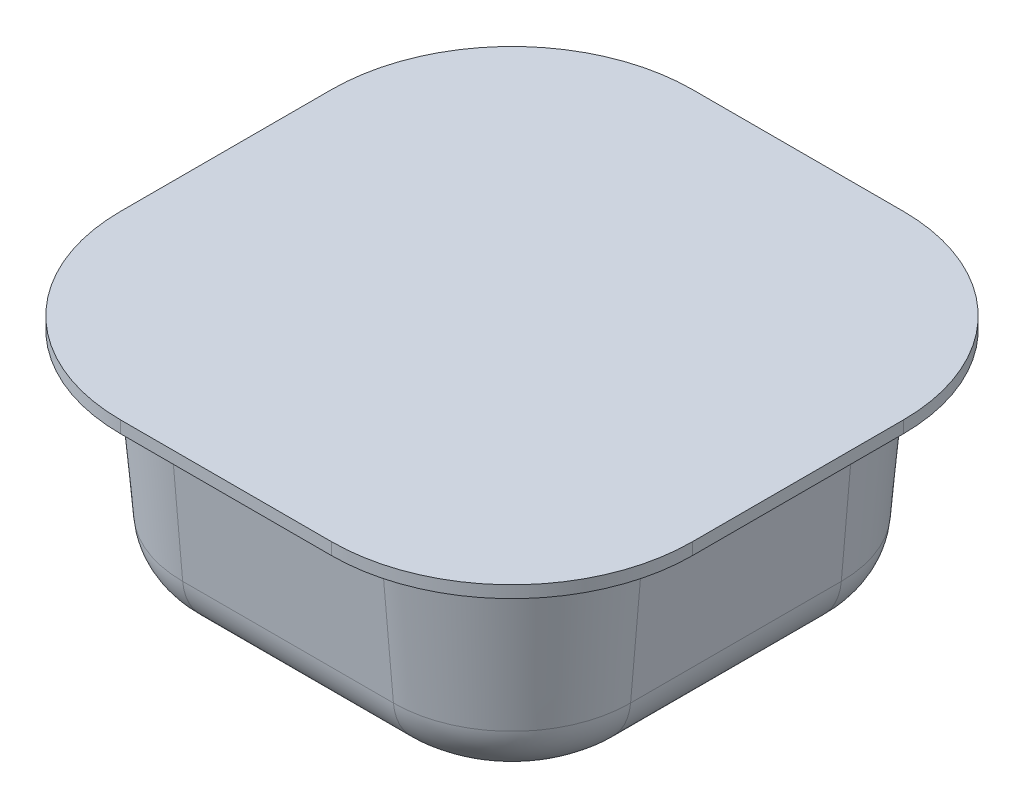
ISO-10303-21;
HEADER;
FILE_DESCRIPTION(('STEP AP214'),'2;1');
FILE_NAME('part.step','',(''),(''),'','','');
FILE_SCHEMA(('AUTOMOTIVE_DESIGN { 1 0 10303 214 1 1 1 1 }'));
ENDSEC;
DATA;
#1=APPLICATION_CONTEXT('core data for automotive mechanical design processes');
#2=APPLICATION_PROTOCOL_DEFINITION('international standard','automotive_design',2000,#1);
#3=PRODUCT_CONTEXT('',#1,'mechanical');
#4=PRODUCT('Part','Part','',(#3));
#5=PRODUCT_RELATED_PRODUCT_CATEGORY('part','',(#4));
#6=PRODUCT_DEFINITION_FORMATION('','',#4);
#7=PRODUCT_DEFINITION_CONTEXT('part definition',#1,'design');
#8=PRODUCT_DEFINITION('design','',#6,#7);
#9=PRODUCT_DEFINITION_SHAPE('','',#8);
#10=(LENGTH_UNIT() NAMED_UNIT(*) SI_UNIT(.MILLI.,.METRE.));
#11=(NAMED_UNIT(*) PLANE_ANGLE_UNIT() SI_UNIT($,.RADIAN.));
#12=(NAMED_UNIT(*) SI_UNIT($,.STERADIAN.) SOLID_ANGLE_UNIT());
#13=UNCERTAINTY_MEASURE_WITH_UNIT(LENGTH_MEASURE(1.E-05),#10,'distance_accuracy_value','');
#14=(GEOMETRIC_REPRESENTATION_CONTEXT(3) GLOBAL_UNCERTAINTY_ASSIGNED_CONTEXT((#13)) GLOBAL_UNIT_ASSIGNED_CONTEXT((#10,
#11,#12)) REPRESENTATION_CONTEXT('',''));
#15=CARTESIAN_POINT('',(0.,0.,0.));
#16=DIRECTION('',(0.,0.,1.));
#17=DIRECTION('',(1.,0.,0.));
#18=AXIS2_PLACEMENT_3D('',#15,#16,#17);
#19=CARTESIAN_POINT('',(-24.13,18.034,-24.13));
#20=DIRECTION('',(-1.,0.,0.));
#21=DIRECTION('',(0.,0.,1.));
#22=AXIS2_PLACEMENT_3D('',#19,#20,#21);
#23=PLANE('',#22);
#24=DIRECTION('',(0.,0.,1.));
#25=VECTOR('',#24,1.);
#26=CARTESIAN_POINT('',(-24.13,18.034,-24.13));
#27=LINE('',#26,#25);
#28=CARTESIAN_POINT('',(-24.13,18.034,-8.89));
#29=VERTEX_POINT('',#28);
#30=CARTESIAN_POINT('',(-24.13,18.034,8.88999999999999));
#31=VERTEX_POINT('',#30);
#32=EDGE_CURVE('E258',#29,#31,#27,.T.);
#33=ORIENTED_EDGE('',*,*,#32,.T.);
#34=DIRECTION('',(0.,1.,0.));
#35=VECTOR('',#34,1.);
#36=CARTESIAN_POINT('',(-24.13,18.034,8.89000000000001));
#37=LINE('',#36,#35);
#38=CARTESIAN_POINT('',(-24.13,19.05,8.88999999999999));
#39=VERTEX_POINT('',#38);
#40=EDGE_CURVE('E292',#31,#39,#37,.T.);
#41=ORIENTED_EDGE('',*,*,#40,.T.);
#42=DIRECTION('',(0.,0.,1.));
#43=VECTOR('',#42,1.);
#44=CARTESIAN_POINT('',(-24.13,19.05,-24.13));
#45=LINE('',#44,#43);
#46=CARTESIAN_POINT('',(-24.13,19.05,-8.89));
#47=VERTEX_POINT('',#46);
#48=EDGE_CURVE('E241',#47,#39,#45,.T.);
#49=ORIENTED_EDGE('',*,*,#48,.F.);
#50=DIRECTION('',(0.,1.,0.));
#51=VECTOR('',#50,1.);
#52=CARTESIAN_POINT('',(-24.13,18.034,-8.88999999999999));
#53=LINE('',#52,#51);
#54=EDGE_CURVE('E275',#47,#29,#53,.F.);
#55=ORIENTED_EDGE('',*,*,#54,.T.);
#56=EDGE_LOOP('',(#33,#41,#49,#55));
#57=FACE_BOUND('',#56,.T.);
#58=ADVANCED_FACE('F47',(#57),#23,.T.);
#59=CARTESIAN_POINT('',(24.13,18.034,-24.13));
#60=DIRECTION('',(0.,0.,-1.));
#61=DIRECTION('',(-1.,0.,0.));
#62=AXIS2_PLACEMENT_3D('',#59,#60,#61);
#63=PLANE('',#62);
#64=DIRECTION('',(-1.,0.,0.));
#65=VECTOR('',#64,1.);
#66=CARTESIAN_POINT('',(24.13,19.05,-24.13));
#67=LINE('',#66,#65);
#68=CARTESIAN_POINT('',(8.89,19.05,-24.13));
#69=VERTEX_POINT('',#68);
#70=CARTESIAN_POINT('',(-8.88999999999999,19.05,-24.13));
#71=VERTEX_POINT('',#70);
#72=EDGE_CURVE('E263',#69,#71,#67,.T.);
#73=ORIENTED_EDGE('',*,*,#72,.F.);
#74=DIRECTION('',(0.,1.,0.));
#75=VECTOR('',#74,1.);
#76=CARTESIAN_POINT('',(8.88999999999999,18.034,-24.13));
#77=LINE('',#76,#75);
#78=CARTESIAN_POINT('',(8.89,18.034,-24.13));
#79=VERTEX_POINT('',#78);
#80=EDGE_CURVE('E338',#69,#79,#77,.F.);
#81=ORIENTED_EDGE('',*,*,#80,.T.);
#82=DIRECTION('',(-1.,0.,0.));
#83=VECTOR('',#82,1.);
#84=CARTESIAN_POINT('',(24.13,18.034,-24.13));
#85=LINE('',#84,#83);
#86=CARTESIAN_POINT('',(-8.88999999999999,18.034,-24.13));
#87=VERTEX_POINT('',#86);
#88=EDGE_CURVE('E271',#79,#87,#85,.T.);
#89=ORIENTED_EDGE('',*,*,#88,.T.);
#90=DIRECTION('',(0.,1.,0.));
#91=VECTOR('',#90,1.);
#92=CARTESIAN_POINT('',(-8.89000000000001,18.034,-24.13));
#93=LINE('',#92,#91);
#94=EDGE_CURVE('E334',#87,#71,#93,.T.);
#95=ORIENTED_EDGE('',*,*,#94,.T.);
#96=EDGE_LOOP('',(#73,#81,#89,#95));
#97=FACE_BOUND('',#96,.T.);
#98=ADVANCED_FACE('F462',(#97),#63,.T.);
#99=CARTESIAN_POINT('',(24.13,18.034,-24.13));
#100=DIRECTION('',(1.,0.,0.));
#101=DIRECTION('',(0.,0.,-1.));
#102=AXIS2_PLACEMENT_3D('',#99,#100,#101);
#103=PLANE('',#102);
#104=DIRECTION('',(0.,0.,-1.));
#105=VECTOR('',#104,1.);
#106=CARTESIAN_POINT('',(24.13,18.034,-24.13));
#107=LINE('',#106,#105);
#108=CARTESIAN_POINT('',(24.13,18.034,8.88999999999998));
#109=VERTEX_POINT('',#108);
#110=CARTESIAN_POINT('',(24.13,18.034,-8.89));
#111=VERTEX_POINT('',#110);
#112=EDGE_CURVE('E267',#109,#111,#107,.T.);
#113=ORIENTED_EDGE('',*,*,#112,.T.);
#114=DIRECTION('',(0.,1.,0.));
#115=VECTOR('',#114,1.);
#116=CARTESIAN_POINT('',(24.13,18.034,-8.89));
#117=LINE('',#116,#115);
#118=CARTESIAN_POINT('',(24.13,19.05,-8.89));
#119=VERTEX_POINT('',#118);
#120=EDGE_CURVE('E330',#111,#119,#117,.T.);
#121=ORIENTED_EDGE('',*,*,#120,.T.);
#122=DIRECTION('',(0.,0.,-1.));
#123=VECTOR('',#122,1.);
#124=CARTESIAN_POINT('',(24.13,19.05,-24.13));
#125=LINE('',#124,#123);
#126=CARTESIAN_POINT('',(24.13,19.05,8.88999999999998));
#127=VERTEX_POINT('',#126);
#128=EDGE_CURVE('E283',#127,#119,#125,.T.);
#129=ORIENTED_EDGE('',*,*,#128,.F.);
#130=DIRECTION('',(0.,1.,0.));
#131=VECTOR('',#130,1.);
#132=CARTESIAN_POINT('',(24.13,18.034,8.88999999999999));
#133=LINE('',#132,#131);
#134=EDGE_CURVE('E327',#127,#109,#133,.F.);
#135=ORIENTED_EDGE('',*,*,#134,.T.);
#136=EDGE_LOOP('',(#113,#121,#129,#135));
#137=FACE_BOUND('',#136,.T.);
#138=ADVANCED_FACE('F468',(#137),#103,.T.);
#139=CARTESIAN_POINT('',(24.13,18.034,24.13));
#140=DIRECTION('',(0.,0.,1.));
#141=DIRECTION('',(1.,0.,0.));
#142=AXIS2_PLACEMENT_3D('',#139,#140,#141);
#143=PLANE('',#142);
#144=DIRECTION('',(1.,0.,0.));
#145=VECTOR('',#144,1.);
#146=CARTESIAN_POINT('',(24.13,19.05,24.13));
#147=LINE('',#146,#145);
#148=CARTESIAN_POINT('',(-8.88999999999998,19.05,24.13));
#149=VERTEX_POINT('',#148);
#150=CARTESIAN_POINT('',(8.89,19.05,24.13));
#151=VERTEX_POINT('',#150);
#152=EDGE_CURVE('E279',#149,#151,#147,.T.);
#153=ORIENTED_EDGE('',*,*,#152,.F.);
#154=DIRECTION('',(0.,1.,0.));
#155=VECTOR('',#154,1.);
#156=CARTESIAN_POINT('',(-8.88999999999999,18.034,24.13));
#157=LINE('',#156,#155);
#158=CARTESIAN_POINT('',(-8.88999999999998,18.034,24.13));
#159=VERTEX_POINT('',#158);
#160=EDGE_CURVE('E312',#149,#159,#157,.F.);
#161=ORIENTED_EDGE('',*,*,#160,.T.);
#162=DIRECTION('',(1.,0.,0.));
#163=VECTOR('',#162,1.);
#164=CARTESIAN_POINT('',(24.13,18.034,24.13));
#165=LINE('',#164,#163);
#166=CARTESIAN_POINT('',(8.89,18.034,24.13));
#167=VERTEX_POINT('',#166);
#168=EDGE_CURVE('E262',#159,#167,#165,.T.);
#169=ORIENTED_EDGE('',*,*,#168,.T.);
#170=DIRECTION('',(0.,1.,0.));
#171=VECTOR('',#170,1.);
#172=CARTESIAN_POINT('',(8.89,18.034,24.13));
#173=LINE('',#172,#171);
#174=EDGE_CURVE('E308',#167,#151,#173,.T.);
#175=ORIENTED_EDGE('',*,*,#174,.T.);
#176=EDGE_LOOP('',(#153,#161,#169,#175));
#177=FACE_BOUND('',#176,.T.);
#178=ADVANCED_FACE('F473',(#177),#143,.T.);
#179=CARTESIAN_POINT('',(0.,18.034,0.));
#180=DIRECTION('',(0.,-1.,0.));
#181=DIRECTION('',(0.,0.,-1.));
#182=AXIS2_PLACEMENT_3D('',#179,#180,#181);
#183=PLANE('',#182);
#184=CARTESIAN_POINT('',(8.89,18.034,8.89));
#185=DIRECTION('',(0.,-1.,0.));
#186=DIRECTION('',(0.,0.,-1.));
#187=AXIS2_PLACEMENT_3D('',#184,#185,#186);
#188=CIRCLE('',#187,11.176);
#189=CARTESIAN_POINT('',(20.066,18.034,8.88999999999998));
#190=VERTEX_POINT('',#189);
#191=CARTESIAN_POINT('',(8.89,18.034,20.066));
#192=VERTEX_POINT('',#191);
#193=EDGE_CURVE('E215',#190,#192,#188,.T.);
#194=ORIENTED_EDGE('',*,*,#193,.F.);
#195=DIRECTION('',(0.,0.,1.));
#196=VECTOR('',#195,1.);
#197=CARTESIAN_POINT('',(20.066,18.034,-8.89));
#198=LINE('',#197,#196);
#199=CARTESIAN_POINT('',(20.066,18.034,-8.89));
#200=VERTEX_POINT('',#199);
#201=EDGE_CURVE('E234',#200,#190,#198,.T.);
#202=ORIENTED_EDGE('',*,*,#201,.F.);
#203=CARTESIAN_POINT('',(8.89,18.034,-8.89));
#204=DIRECTION('',(0.,-1.,0.));
#205=DIRECTION('',(0.,0.,-1.));
#206=AXIS2_PLACEMENT_3D('',#203,#204,#205);
#207=CIRCLE('',#206,11.176);
#208=CARTESIAN_POINT('',(8.89,18.034,-20.066));
#209=VERTEX_POINT('',#208);
#210=EDGE_CURVE('E230',#209,#200,#207,.T.);
#211=ORIENTED_EDGE('',*,*,#210,.F.);
#212=DIRECTION('',(1.,0.,0.));
#213=VECTOR('',#212,1.);
#214=CARTESIAN_POINT('',(-8.88999999999999,18.034,-20.066));
#215=LINE('',#214,#213);
#216=CARTESIAN_POINT('',(-8.89,18.034,-20.066));
#217=VERTEX_POINT('',#216);
#218=EDGE_CURVE('E226',#217,#209,#215,.T.);
#219=ORIENTED_EDGE('',*,*,#218,.F.);
#220=CARTESIAN_POINT('',(-8.89,18.034,-8.89));
#221=DIRECTION('',(0.,-1.,0.));
#222=DIRECTION('',(0.,0.,-1.));
#223=AXIS2_PLACEMENT_3D('',#220,#221,#222);
#224=CIRCLE('',#223,11.176);
#225=CARTESIAN_POINT('',(-20.066,18.034,-8.89));
#226=VERTEX_POINT('',#225);
#227=EDGE_CURVE('E222',#226,#217,#224,.T.);
#228=ORIENTED_EDGE('',*,*,#227,.F.);
#229=DIRECTION('',(0.,0.,-1.));
#230=VECTOR('',#229,1.);
#231=CARTESIAN_POINT('',(-20.066,18.034,8.89));
#232=LINE('',#231,#230);
#233=CARTESIAN_POINT('',(-20.066,18.034,8.89));
#234=VERTEX_POINT('',#233);
#235=EDGE_CURVE('E209',#234,#226,#232,.T.);
#236=ORIENTED_EDGE('',*,*,#235,.F.);
#237=CARTESIAN_POINT('',(-8.89,18.034,8.89));
#238=DIRECTION('',(0.,-1.,0.));
#239=DIRECTION('',(0.,0.,-1.));
#240=AXIS2_PLACEMENT_3D('',#237,#238,#239);
#241=CIRCLE('',#240,11.176);
#242=CARTESIAN_POINT('',(-8.88999999999998,18.034,20.066));
#243=VERTEX_POINT('',#242);
#244=EDGE_CURVE('E189',#243,#234,#241,.T.);
#245=ORIENTED_EDGE('',*,*,#244,.F.);
#246=DIRECTION('',(-1.,0.,0.));
#247=VECTOR('',#246,1.);
#248=CARTESIAN_POINT('',(8.89,18.034,20.066));
#249=LINE('',#248,#247);
#250=EDGE_CURVE('E205',#192,#243,#249,.T.);
#251=ORIENTED_EDGE('',*,*,#250,.F.);
#252=EDGE_LOOP('',(#194,#202,#211,#219,#228,#236,#245,#251));
#253=FACE_BOUND('',#252,.T.);
#254=ORIENTED_EDGE('',*,*,#168,.F.);
#255=CARTESIAN_POINT('',(-8.89,18.034,8.89));
#256=DIRECTION('',(0.,-1.,0.));
#257=DIRECTION('',(0.,0.,-1.));
#258=AXIS2_PLACEMENT_3D('',#255,#256,#257);
#259=CIRCLE('',#258,15.24);
#260=EDGE_CURVE('E324',#159,#31,#259,.T.);
#261=ORIENTED_EDGE('',*,*,#260,.T.);
#262=ORIENTED_EDGE('',*,*,#32,.F.);
#263=CARTESIAN_POINT('',(-8.89,18.034,-8.89));
#264=DIRECTION('',(0.,-1.,0.));
#265=DIRECTION('',(0.,0.,-1.));
#266=AXIS2_PLACEMENT_3D('',#263,#264,#265);
#267=CIRCLE('',#266,15.24);
#268=EDGE_CURVE('E318',#29,#87,#267,.T.);
#269=ORIENTED_EDGE('',*,*,#268,.T.);
#270=ORIENTED_EDGE('',*,*,#88,.F.);
#271=CARTESIAN_POINT('',(8.89,18.034,-8.89));
#272=DIRECTION('',(0.,-1.,0.));
#273=DIRECTION('',(0.,0.,-1.));
#274=AXIS2_PLACEMENT_3D('',#271,#272,#273);
#275=CIRCLE('',#274,15.24);
#276=EDGE_CURVE('E321',#79,#111,#275,.T.);
#277=ORIENTED_EDGE('',*,*,#276,.T.);
#278=ORIENTED_EDGE('',*,*,#112,.F.);
#279=CARTESIAN_POINT('',(8.89,18.034,8.89));
#280=DIRECTION('',(0.,-1.,0.));
#281=DIRECTION('',(0.,0.,-1.));
#282=AXIS2_PLACEMENT_3D('',#279,#280,#281);
#283=CIRCLE('',#282,15.24);
#284=EDGE_CURVE('E315',#109,#167,#283,.T.);
#285=ORIENTED_EDGE('',*,*,#284,.T.);
#286=EDGE_LOOP('',(#254,#261,#262,#269,#270,#277,#278,#285));
#287=FACE_BOUND('',#286,.T.);
#288=ADVANCED_FACE('F203',(#253,#287),#183,.T.);
#289=CARTESIAN_POINT('',(0.,19.05,0.));
#290=DIRECTION('',(0.,-1.,0.));
#291=DIRECTION('',(0.,0.,-1.));
#292=AXIS2_PLACEMENT_3D('',#289,#290,#291);
#293=PLANE('',#292);
#294=ORIENTED_EDGE('',*,*,#48,.T.);
#295=CARTESIAN_POINT('',(-8.89,19.05,8.89));
#296=DIRECTION('',(0.,-1.,0.));
#297=DIRECTION('',(0.,0.,-1.));
#298=AXIS2_PLACEMENT_3D('',#295,#296,#297);
#299=CIRCLE('',#298,15.24);
#300=EDGE_CURVE('E305',#39,#149,#299,.F.);
#301=ORIENTED_EDGE('',*,*,#300,.T.);
#302=ORIENTED_EDGE('',*,*,#152,.T.);
#303=CARTESIAN_POINT('',(8.89,19.05,8.89));
#304=DIRECTION('',(0.,-1.,0.));
#305=DIRECTION('',(0.,0.,-1.));
#306=AXIS2_PLACEMENT_3D('',#303,#304,#305);
#307=CIRCLE('',#306,15.24);
#308=EDGE_CURVE('E296',#151,#127,#307,.F.);
#309=ORIENTED_EDGE('',*,*,#308,.T.);
#310=ORIENTED_EDGE('',*,*,#128,.T.);
#311=CARTESIAN_POINT('',(8.89,19.05,-8.89));
#312=DIRECTION('',(0.,-1.,0.));
#313=DIRECTION('',(0.,0.,-1.));
#314=AXIS2_PLACEMENT_3D('',#311,#312,#313);
#315=CIRCLE('',#314,15.24);
#316=EDGE_CURVE('E302',#119,#69,#315,.F.);
#317=ORIENTED_EDGE('',*,*,#316,.T.);
#318=ORIENTED_EDGE('',*,*,#72,.T.);
#319=CARTESIAN_POINT('',(-8.89,19.05,-8.89));
#320=DIRECTION('',(0.,-1.,0.));
#321=DIRECTION('',(0.,0.,-1.));
#322=AXIS2_PLACEMENT_3D('',#319,#320,#321);
#323=CIRCLE('',#322,15.24);
#324=EDGE_CURVE('E299',#71,#47,#323,.F.);
#325=ORIENTED_EDGE('',*,*,#324,.T.);
#326=EDGE_LOOP('',(#294,#301,#302,#309,#310,#317,#318,#325));
#327=FACE_BOUND('',#326,.T.);
#328=ADVANCED_FACE('F479',(#327),#293,.F.);
#329=CARTESIAN_POINT('',(-8.89,18.034,8.89));
#330=DIRECTION('',(0.,1.,0.));
#331=DIRECTION('',(0.,0.,1.));
#332=AXIS2_PLACEMENT_3D('',#329,#330,#331);
#333=CYLINDRICAL_SURFACE('',#332,15.24);
#334=ORIENTED_EDGE('',*,*,#260,.F.);
#335=ORIENTED_EDGE('',*,*,#160,.F.);
#336=ORIENTED_EDGE('',*,*,#300,.F.);
#337=ORIENTED_EDGE('',*,*,#40,.F.);
#338=EDGE_LOOP('',(#334,#335,#336,#337));
#339=FACE_BOUND('',#338,.T.);
#340=ADVANCED_FACE('F475',(#339),#333,.T.);
#341=CARTESIAN_POINT('',(8.89,18.034,-8.89));
#342=DIRECTION('',(0.,1.,0.));
#343=DIRECTION('',(0.,0.,1.));
#344=AXIS2_PLACEMENT_3D('',#341,#342,#343);
#345=CYLINDRICAL_SURFACE('',#344,15.24);
#346=ORIENTED_EDGE('',*,*,#276,.F.);
#347=ORIENTED_EDGE('',*,*,#80,.F.);
#348=ORIENTED_EDGE('',*,*,#316,.F.);
#349=ORIENTED_EDGE('',*,*,#120,.F.);
#350=EDGE_LOOP('',(#346,#347,#348,#349));
#351=FACE_BOUND('',#350,.T.);
#352=ADVANCED_FACE('F478',(#351),#345,.T.);
#353=CARTESIAN_POINT('',(-8.89,18.034,-8.89));
#354=DIRECTION('',(0.,1.,0.));
#355=DIRECTION('',(0.,0.,1.));
#356=AXIS2_PLACEMENT_3D('',#353,#354,#355);
#357=CYLINDRICAL_SURFACE('',#356,15.24);
#358=ORIENTED_EDGE('',*,*,#268,.F.);
#359=ORIENTED_EDGE('',*,*,#54,.F.);
#360=ORIENTED_EDGE('',*,*,#324,.F.);
#361=ORIENTED_EDGE('',*,*,#94,.F.);
#362=EDGE_LOOP('',(#358,#359,#360,#361));
#363=FACE_BOUND('',#362,.T.);
#364=ADVANCED_FACE('F483',(#363),#357,.T.);
#365=CARTESIAN_POINT('',(8.89,18.034,8.89));
#366=DIRECTION('',(0.,1.,0.));
#367=DIRECTION('',(0.,0.,1.));
#368=AXIS2_PLACEMENT_3D('',#365,#366,#367);
#369=CYLINDRICAL_SURFACE('',#368,15.24);
#370=ORIENTED_EDGE('',*,*,#284,.F.);
#371=ORIENTED_EDGE('',*,*,#134,.F.);
#372=ORIENTED_EDGE('',*,*,#308,.F.);
#373=ORIENTED_EDGE('',*,*,#174,.F.);
#374=EDGE_LOOP('',(#370,#371,#372,#373));
#375=FACE_BOUND('',#374,.T.);
#376=ADVANCED_FACE('F486',(#375),#369,.T.);
#377=CARTESIAN_POINT('',(20.066,18.034,-8.89));
#378=DIRECTION('',(0.996194698091746,-0.0871557427476582,0.));
#379=DIRECTION('',(0.0871557427476582,0.996194698091746,0.));
#380=AXIS2_PLACEMENT_3D('',#377,#378,#379);
#381=PLANE('',#380);
#382=DIRECTION('',(0.0871557427476582,0.996194698091746,0.));
#383=VECTOR('',#382,1.);
#384=CARTESIAN_POINT('',(20.066,18.034,8.88999999999998));
#385=LINE('',#384,#383);
#386=CARTESIAN_POINT('',(18.893936144271,4.63724882684189,8.88999999999998));
#387=VERTEX_POINT('',#386);
#388=EDGE_CURVE('E238',#387,#190,#385,.T.);
#389=ORIENTED_EDGE('',*,*,#388,.F.);
#390=DIRECTION('',(0.,0.,-1.));
#391=VECTOR('',#390,1.);
#392=CARTESIAN_POINT('',(18.893936144271,4.63724882684189,-8.89));
#393=LINE('',#392,#391);
#394=CARTESIAN_POINT('',(18.893936144271,4.63724882684189,-8.89));
#395=VERTEX_POINT('',#394);
#396=EDGE_CURVE('E11',#387,#395,#393,.T.);
#397=ORIENTED_EDGE('',*,*,#396,.T.);
#398=DIRECTION('',(0.0871557427476582,0.996194698091746,0.));
#399=VECTOR('',#398,1.);
#400=CARTESIAN_POINT('',(20.066,18.034,-8.89));
#401=LINE('',#400,#399);
#402=EDGE_CURVE('E244',#395,#200,#401,.T.);
#403=ORIENTED_EDGE('',*,*,#402,.T.);
#404=ORIENTED_EDGE('',*,*,#201,.T.);
#405=EDGE_LOOP('',(#389,#397,#403,#404));
#406=FACE_BOUND('',#405,.T.);
#407=ADVANCED_FACE('F441',(#406),#381,.T.);
#408=CARTESIAN_POINT('',(8.89,18.034,-8.89));
#409=DIRECTION('',(0.,1.,0.));
#410=DIRECTION('',(0.,0.,-1.));
#411=AXIS2_PLACEMENT_3D('',#408,#409,#410);
#412=CONICAL_SURFACE('',#411,11.176,0.0872664625997165);
#413=ORIENTED_EDGE('',*,*,#402,.F.);
#414=CARTESIAN_POINT('',(8.89,4.63724882684191,-8.89));
#415=DIRECTION('',(0.,-1.,0.));
#416=DIRECTION('',(0.,0.,-1.));
#417=AXIS2_PLACEMENT_3D('',#414,#415,#416);
#418=CIRCLE('',#417,10.003936144271);
#419=CARTESIAN_POINT('',(8.89,4.63724882684189,-18.893936144271));
#420=VERTEX_POINT('',#419);
#421=EDGE_CURVE('E57',#395,#420,#418,.F.);
#422=ORIENTED_EDGE('',*,*,#421,.T.);
#423=DIRECTION('',(0.,0.996194698091746,-0.0871557427476582));
#424=VECTOR('',#423,1.);
#425=CARTESIAN_POINT('',(8.89,18.034,-20.066));
#426=LINE('',#425,#424);
#427=EDGE_CURVE('E247',#420,#209,#426,.T.);
#428=ORIENTED_EDGE('',*,*,#427,.T.);
#429=ORIENTED_EDGE('',*,*,#210,.T.);
#430=EDGE_LOOP('',(#413,#422,#428,#429));
#431=FACE_BOUND('',#430,.T.);
#432=ADVANCED_FACE('F442',(#431),#412,.T.);
#433=CARTESIAN_POINT('',(-8.88999999999999,18.034,-20.066));
#434=DIRECTION('',(0.,-0.0871557427476582,-0.996194698091746));
#435=DIRECTION('',(0.,0.996194698091746,-0.0871557427476582));
#436=AXIS2_PLACEMENT_3D('',#433,#434,#435);
#437=PLANE('',#436);
#438=ORIENTED_EDGE('',*,*,#427,.F.);
#439=DIRECTION('',(-1.,0.,0.));
#440=VECTOR('',#439,1.);
#441=CARTESIAN_POINT('',(-8.88999999999999,4.63724882684189,-18.893936144271));
#442=LINE('',#441,#440);
#443=CARTESIAN_POINT('',(-8.89,4.63724882684189,-18.893936144271));
#444=VERTEX_POINT('',#443);
#445=EDGE_CURVE('E381',#420,#444,#442,.T.);
#446=ORIENTED_EDGE('',*,*,#445,.T.);
#447=DIRECTION('',(0.,0.996194698091746,-0.0871557427476582));
#448=VECTOR('',#447,1.);
#449=CARTESIAN_POINT('',(-8.89,18.034,-20.066));
#450=LINE('',#449,#448);
#451=EDGE_CURVE('E250',#444,#217,#450,.T.);
#452=ORIENTED_EDGE('',*,*,#451,.T.);
#453=ORIENTED_EDGE('',*,*,#218,.T.);
#454=EDGE_LOOP('',(#438,#446,#452,#453));
#455=FACE_BOUND('',#454,.T.);
#456=ADVANCED_FACE('F582',(#455),#437,.T.);
#457=CARTESIAN_POINT('',(-8.89,18.034,-8.89));
#458=DIRECTION('',(0.,1.,0.));
#459=DIRECTION('',(0.,0.,-1.));
#460=AXIS2_PLACEMENT_3D('',#457,#458,#459);
#461=CONICAL_SURFACE('',#460,11.176,0.0872664625997165);
#462=ORIENTED_EDGE('',*,*,#451,.F.);
#463=CARTESIAN_POINT('',(-8.89,4.6372488268419,-8.89));
#464=DIRECTION('',(0.,-1.,0.));
#465=DIRECTION('',(0.,0.,-1.));
#466=AXIS2_PLACEMENT_3D('',#463,#464,#465);
#467=CIRCLE('',#466,10.003936144271);
#468=CARTESIAN_POINT('',(-18.893936144271,4.63724882684189,-8.89));
#469=VERTEX_POINT('',#468);
#470=EDGE_CURVE('E378',#444,#469,#467,.F.);
#471=ORIENTED_EDGE('',*,*,#470,.T.);
#472=DIRECTION('',(-0.0871557427476582,0.996194698091746,0.));
#473=VECTOR('',#472,1.);
#474=CARTESIAN_POINT('',(-20.066,18.034,-8.89));
#475=LINE('',#474,#473);
#476=EDGE_CURVE('E253',#469,#226,#475,.T.);
#477=ORIENTED_EDGE('',*,*,#476,.T.);
#478=ORIENTED_EDGE('',*,*,#227,.T.);
#479=EDGE_LOOP('',(#462,#471,#477,#478));
#480=FACE_BOUND('',#479,.T.);
#481=ADVANCED_FACE('F591',(#480),#461,.T.);
#482=CARTESIAN_POINT('',(-20.066,18.034,8.89));
#483=DIRECTION('',(-0.996194698091745,-0.0871557427476582,0.));
#484=DIRECTION('',(0.0871557427476582,-0.996194698091746,0.));
#485=AXIS2_PLACEMENT_3D('',#482,#483,#484);
#486=PLANE('',#485);
#487=ORIENTED_EDGE('',*,*,#476,.F.);
#488=DIRECTION('',(0.,0.,1.));
#489=VECTOR('',#488,1.);
#490=CARTESIAN_POINT('',(-18.893936144271,4.6372488268419,8.89));
#491=LINE('',#490,#489);
#492=CARTESIAN_POINT('',(-18.893936144271,4.63724882684189,8.89));
#493=VERTEX_POINT('',#492);
#494=EDGE_CURVE('E375',#469,#493,#491,.T.);
#495=ORIENTED_EDGE('',*,*,#494,.T.);
#496=DIRECTION('',(-0.0871557427476582,0.996194698091746,0.));
#497=VECTOR('',#496,1.);
#498=CARTESIAN_POINT('',(-20.066,18.034,8.89));
#499=LINE('',#498,#497);
#500=EDGE_CURVE('E197',#493,#234,#499,.T.);
#501=ORIENTED_EDGE('',*,*,#500,.T.);
#502=ORIENTED_EDGE('',*,*,#235,.T.);
#503=EDGE_LOOP('',(#487,#495,#501,#502));
#504=FACE_BOUND('',#503,.T.);
#505=ADVANCED_FACE('F601',(#504),#486,.T.);
#506=CARTESIAN_POINT('',(-8.89,18.034,8.89));
#507=DIRECTION('',(0.,1.,0.));
#508=DIRECTION('',(0.,0.,-1.));
#509=AXIS2_PLACEMENT_3D('',#506,#507,#508);
#510=CONICAL_SURFACE('',#509,11.176,0.0872664625997165);
#511=ORIENTED_EDGE('',*,*,#500,.F.);
#512=CARTESIAN_POINT('',(-8.89,4.6372488268419,8.89));
#513=DIRECTION('',(0.,-1.,0.));
#514=DIRECTION('',(0.,0.,-1.));
#515=AXIS2_PLACEMENT_3D('',#512,#513,#514);
#516=CIRCLE('',#515,10.003936144271);
#517=CARTESIAN_POINT('',(-8.88999999999998,4.63724882684189,18.893936144271));
#518=VERTEX_POINT('',#517);
#519=EDGE_CURVE('E191',#493,#518,#516,.F.);
#520=ORIENTED_EDGE('',*,*,#519,.T.);
#521=DIRECTION('',(0.,0.996194698091746,0.0871557427476582));
#522=VECTOR('',#521,1.);
#523=CARTESIAN_POINT('',(-8.88999999999998,18.034,20.066));
#524=LINE('',#523,#522);
#525=EDGE_CURVE('E185',#518,#243,#524,.T.);
#526=ORIENTED_EDGE('',*,*,#525,.T.);
#527=ORIENTED_EDGE('',*,*,#244,.T.);
#528=EDGE_LOOP('',(#511,#520,#526,#527));
#529=FACE_BOUND('',#528,.T.);
#530=ADVANCED_FACE('F188',(#529),#510,.T.);
#531=CARTESIAN_POINT('',(8.89,18.034,20.066));
#532=DIRECTION('',(0.,-0.0871557427476582,0.996194698091746));
#533=DIRECTION('',(0.,-0.996194698091746,-0.0871557427476582));
#534=AXIS2_PLACEMENT_3D('',#531,#532,#533);
#535=PLANE('',#534);
#536=ORIENTED_EDGE('',*,*,#525,.F.);
#537=DIRECTION('',(1.,0.,0.));
#538=VECTOR('',#537,1.);
#539=CARTESIAN_POINT('',(8.89,4.63724882684189,18.893936144271));
#540=LINE('',#539,#538);
#541=CARTESIAN_POINT('',(8.89,4.63724882684189,18.893936144271));
#542=VERTEX_POINT('',#541);
#543=EDGE_CURVE('E370',#518,#542,#540,.T.);
#544=ORIENTED_EDGE('',*,*,#543,.T.);
#545=DIRECTION('',(0.,0.996194698091746,0.0871557427476582));
#546=VECTOR('',#545,1.);
#547=CARTESIAN_POINT('',(8.89,18.034,20.066));
#548=LINE('',#547,#546);
#549=EDGE_CURVE('E196',#542,#192,#548,.T.);
#550=ORIENTED_EDGE('',*,*,#549,.T.);
#551=ORIENTED_EDGE('',*,*,#250,.T.);
#552=EDGE_LOOP('',(#536,#544,#550,#551));
#553=FACE_BOUND('',#552,.T.);
#554=ADVANCED_FACE('F212',(#553),#535,.T.);
#555=CARTESIAN_POINT('',(8.89,18.034,8.89));
#556=DIRECTION('',(0.,1.,0.));
#557=DIRECTION('',(0.,0.,-1.));
#558=AXIS2_PLACEMENT_3D('',#555,#556,#557);
#559=CONICAL_SURFACE('',#558,11.176,0.0872664625997165);
#560=ORIENTED_EDGE('',*,*,#549,.F.);
#561=CARTESIAN_POINT('',(8.89,4.63724882684191,8.89));
#562=DIRECTION('',(0.,-1.,0.));
#563=DIRECTION('',(0.,0.,-1.));
#564=AXIS2_PLACEMENT_3D('',#561,#562,#563);
#565=CIRCLE('',#564,10.003936144271);
#566=EDGE_CURVE('E341',#542,#387,#565,.F.);
#567=ORIENTED_EDGE('',*,*,#566,.T.);
#568=ORIENTED_EDGE('',*,*,#388,.T.);
#569=ORIENTED_EDGE('',*,*,#193,.T.);
#570=EDGE_LOOP('',(#560,#567,#568,#569));
#571=FACE_BOUND('',#570,.T.);
#572=ADVANCED_FACE('F438',(#571),#559,.T.);
#573=CARTESIAN_POINT('',(0.,0.,0.));
#574=DIRECTION('',(0.,1.,0.));
#575=DIRECTION('',(0.,0.,1.));
#576=AXIS2_PLACEMENT_3D('',#573,#574,#575);
#577=PLANE('',#576);
#578=DIRECTION('',(0.,0.,1.));
#579=VECTOR('',#578,1.);
#580=CARTESIAN_POINT('',(13.833267077965,0.,0.));
#581=LINE('',#580,#579);
#582=CARTESIAN_POINT('',(13.833267077965,0.,-8.89));
#583=VERTEX_POINT('',#582);
#584=CARTESIAN_POINT('',(13.833267077965,0.,8.88999999999999));
#585=VERTEX_POINT('',#584);
#586=EDGE_CURVE('E345',#583,#585,#581,.T.);
#587=ORIENTED_EDGE('',*,*,#586,.T.);
#588=CARTESIAN_POINT('',(8.89,0.,8.89));
#589=DIRECTION('',(0.,1.,0.));
#590=DIRECTION('',(0.,0.,1.));
#591=AXIS2_PLACEMENT_3D('',#588,#589,#590);
#592=CIRCLE('',#591,4.94326707796498);
#593=CARTESIAN_POINT('',(8.89,0.,13.833267077965));
#594=VERTEX_POINT('',#593);
#595=EDGE_CURVE('E366',#585,#594,#592,.F.);
#596=ORIENTED_EDGE('',*,*,#595,.T.);
#597=DIRECTION('',(-1.,0.,0.));
#598=VECTOR('',#597,1.);
#599=CARTESIAN_POINT('',(0.,0.,13.833267077965));
#600=LINE('',#599,#598);
#601=CARTESIAN_POINT('',(-8.88999999999998,0.,13.833267077965));
#602=VERTEX_POINT('',#601);
#603=EDGE_CURVE('E363',#594,#602,#600,.T.);
#604=ORIENTED_EDGE('',*,*,#603,.T.);
#605=CARTESIAN_POINT('',(-8.89,0.,8.89));
#606=DIRECTION('',(0.,1.,0.));
#607=DIRECTION('',(0.,0.,1.));
#608=AXIS2_PLACEMENT_3D('',#605,#606,#607);
#609=CIRCLE('',#608,4.94326707796497);
#610=CARTESIAN_POINT('',(-13.833267077965,0.,8.89));
#611=VERTEX_POINT('',#610);
#612=EDGE_CURVE('E360',#602,#611,#609,.F.);
#613=ORIENTED_EDGE('',*,*,#612,.T.);
#614=DIRECTION('',(0.,0.,-1.));
#615=VECTOR('',#614,1.);
#616=CARTESIAN_POINT('',(-13.833267077965,0.,0.));
#617=LINE('',#616,#615);
#618=CARTESIAN_POINT('',(-13.833267077965,0.,-8.89));
#619=VERTEX_POINT('',#618);
#620=EDGE_CURVE('E357',#611,#619,#617,.T.);
#621=ORIENTED_EDGE('',*,*,#620,.T.);
#622=CARTESIAN_POINT('',(-8.89,0.,-8.89));
#623=DIRECTION('',(0.,1.,0.));
#624=DIRECTION('',(0.,0.,1.));
#625=AXIS2_PLACEMENT_3D('',#622,#623,#624);
#626=CIRCLE('',#625,4.94326707796497);
#627=CARTESIAN_POINT('',(-8.89,0.,-13.833267077965));
#628=VERTEX_POINT('',#627);
#629=EDGE_CURVE('E354',#619,#628,#626,.F.);
#630=ORIENTED_EDGE('',*,*,#629,.T.);
#631=DIRECTION('',(1.,0.,0.));
#632=VECTOR('',#631,1.);
#633=CARTESIAN_POINT('',(0.,0.,-13.833267077965));
#634=LINE('',#633,#632);
#635=CARTESIAN_POINT('',(8.89,0.,-13.833267077965));
#636=VERTEX_POINT('',#635);
#637=EDGE_CURVE('E351',#628,#636,#634,.T.);
#638=ORIENTED_EDGE('',*,*,#637,.T.);
#639=CARTESIAN_POINT('',(8.89,0.,-8.89));
#640=DIRECTION('',(0.,1.,0.));
#641=DIRECTION('',(0.,0.,1.));
#642=AXIS2_PLACEMENT_3D('',#639,#640,#641);
#643=CIRCLE('',#642,4.94326707796498);
#644=EDGE_CURVE('E348',#636,#583,#643,.F.);
#645=ORIENTED_EDGE('',*,*,#644,.T.);
#646=EDGE_LOOP('',(#587,#596,#604,#613,#621,#630,#638,#645));
#647=FACE_BOUND('',#646,.T.);
#648=ADVANCED_FACE('F426',(#647),#577,.F.);
#649=CARTESIAN_POINT('',(-8.89,5.08,-8.89));
#650=DIRECTION('',(0.,1.,0.));
#651=DIRECTION('',(0.,0.,1.));
#652=AXIS2_PLACEMENT_3D('',#649,#650,#651);
#653=DEGENERATE_TOROIDAL_SURFACE('',#652,4.94326707796497,5.08,.T.);
#654=CARTESIAN_POINT('',(-8.89,5.08,-13.833267077965));
#655=DIRECTION('',(1.,0.,0.));
#656=DIRECTION('',(0.,0.,-1.));
#657=AXIS2_PLACEMENT_3D('',#654,#655,#656);
#658=CIRCLE('',#657,5.08);
#659=EDGE_CURVE('E407',#628,#444,#658,.T.);
#660=ORIENTED_EDGE('',*,*,#659,.F.);
#661=ORIENTED_EDGE('',*,*,#629,.F.);
#662=CARTESIAN_POINT('',(-13.833267077965,5.08,-8.89));
#663=DIRECTION('',(0.,0.,1.));
#664=DIRECTION('',(0.,-1.,0.));
#665=AXIS2_PLACEMENT_3D('',#662,#663,#664);
#666=CIRCLE('',#665,5.08);
#667=EDGE_CURVE('E51',#469,#619,#666,.T.);
#668=ORIENTED_EDGE('',*,*,#667,.F.);
#669=ORIENTED_EDGE('',*,*,#470,.F.);
#670=EDGE_LOOP('',(#660,#661,#668,#669));
#671=FACE_BOUND('',#670,.T.);
#672=ADVANCED_FACE('F49',(#671),#653,.T.);
#673=CARTESIAN_POINT('',(-13.833267077965,5.08,8.89));
#674=DIRECTION('',(0.,0.,-1.));
#675=DIRECTION('',(-1.,0.,0.));
#676=AXIS2_PLACEMENT_3D('',#673,#674,#675);
#677=CYLINDRICAL_SURFACE('',#676,5.08);
#678=ORIENTED_EDGE('',*,*,#667,.T.);
#679=ORIENTED_EDGE('',*,*,#620,.F.);
#680=CARTESIAN_POINT('',(-13.833267077965,5.08,8.89));
#681=DIRECTION('',(0.,0.,1.));
#682=DIRECTION('',(1.,0.,0.));
#683=AXIS2_PLACEMENT_3D('',#680,#681,#682);
#684=CIRCLE('',#683,5.08);
#685=EDGE_CURVE('E404',#493,#611,#684,.T.);
#686=ORIENTED_EDGE('',*,*,#685,.F.);
#687=ORIENTED_EDGE('',*,*,#494,.F.);
#688=EDGE_LOOP('',(#678,#679,#686,#687));
#689=FACE_BOUND('',#688,.T.);
#690=ADVANCED_FACE('F420',(#689),#677,.T.);
#691=CARTESIAN_POINT('',(-8.88999999999999,5.08,-13.833267077965));
#692=DIRECTION('',(1.,0.,0.));
#693=DIRECTION('',(0.,0.,-1.));
#694=AXIS2_PLACEMENT_3D('',#691,#692,#693);
#695=CYLINDRICAL_SURFACE('',#694,5.08);
#696=ORIENTED_EDGE('',*,*,#659,.T.);
#697=ORIENTED_EDGE('',*,*,#445,.F.);
#698=CARTESIAN_POINT('',(8.89,5.08,-13.833267077965));
#699=DIRECTION('',(1.,0.,0.));
#700=DIRECTION('',(0.,0.,-1.));
#701=AXIS2_PLACEMENT_3D('',#698,#699,#700);
#702=CIRCLE('',#701,5.08);
#703=EDGE_CURVE('E400',#636,#420,#702,.T.);
#704=ORIENTED_EDGE('',*,*,#703,.F.);
#705=ORIENTED_EDGE('',*,*,#637,.F.);
#706=EDGE_LOOP('',(#696,#697,#704,#705));
#707=FACE_BOUND('',#706,.T.);
#708=ADVANCED_FACE('F658',(#707),#695,.T.);
#709=CARTESIAN_POINT('',(-8.89,5.08,8.89));
#710=DIRECTION('',(0.,1.,0.));
#711=DIRECTION('',(0.,0.,1.));
#712=AXIS2_PLACEMENT_3D('',#709,#710,#711);
#713=DEGENERATE_TOROIDAL_SURFACE('',#712,4.94326707796497,5.08,.T.);
#714=ORIENTED_EDGE('',*,*,#685,.T.);
#715=ORIENTED_EDGE('',*,*,#612,.F.);
#716=CARTESIAN_POINT('',(-8.88999999999999,5.08,13.833267077965));
#717=DIRECTION('',(1.,0.,0.));
#718=DIRECTION('',(0.,1.,0.));
#719=AXIS2_PLACEMENT_3D('',#716,#717,#718);
#720=CIRCLE('',#719,5.08);
#721=EDGE_CURVE('E396',#518,#602,#720,.T.);
#722=ORIENTED_EDGE('',*,*,#721,.F.);
#723=ORIENTED_EDGE('',*,*,#519,.F.);
#724=EDGE_LOOP('',(#714,#715,#722,#723));
#725=FACE_BOUND('',#724,.T.);
#726=ADVANCED_FACE('F431',(#725),#713,.T.);
#727=CARTESIAN_POINT('',(8.89,5.08,-8.89));
#728=DIRECTION('',(0.,1.,0.));
#729=DIRECTION('',(0.,0.,1.));
#730=AXIS2_PLACEMENT_3D('',#727,#728,#729);
#731=DEGENERATE_TOROIDAL_SURFACE('',#730,4.94326707796498,5.08,.T.);
#732=ORIENTED_EDGE('',*,*,#703,.T.);
#733=ORIENTED_EDGE('',*,*,#421,.F.);
#734=CARTESIAN_POINT('',(13.833267077965,5.08,-8.89));
#735=DIRECTION('',(0.,0.,1.));
#736=DIRECTION('',(1.,0.,0.));
#737=AXIS2_PLACEMENT_3D('',#734,#735,#736);
#738=CIRCLE('',#737,5.08);
#739=EDGE_CURVE('E392',#583,#395,#738,.T.);
#740=ORIENTED_EDGE('',*,*,#739,.F.);
#741=ORIENTED_EDGE('',*,*,#644,.F.);
#742=EDGE_LOOP('',(#732,#733,#740,#741));
#743=FACE_BOUND('',#742,.T.);
#744=ADVANCED_FACE('F445',(#743),#731,.T.);
#745=CARTESIAN_POINT('',(8.89,5.08,13.833267077965));
#746=DIRECTION('',(-1.,0.,0.));
#747=DIRECTION('',(0.,0.,1.));
#748=AXIS2_PLACEMENT_3D('',#745,#746,#747);
#749=CYLINDRICAL_SURFACE('',#748,5.08);
#750=ORIENTED_EDGE('',*,*,#721,.T.);
#751=ORIENTED_EDGE('',*,*,#603,.F.);
#752=CARTESIAN_POINT('',(8.89,5.08,13.833267077965));
#753=DIRECTION('',(1.,0.,0.));
#754=DIRECTION('',(0.,1.,0.));
#755=AXIS2_PLACEMENT_3D('',#752,#753,#754);
#756=CIRCLE('',#755,5.08);
#757=EDGE_CURVE('E389',#542,#594,#756,.T.);
#758=ORIENTED_EDGE('',*,*,#757,.F.);
#759=ORIENTED_EDGE('',*,*,#543,.F.);
#760=EDGE_LOOP('',(#750,#751,#758,#759));
#761=FACE_BOUND('',#760,.T.);
#762=ADVANCED_FACE('F434',(#761),#749,.T.);
#763=CARTESIAN_POINT('',(13.833267077965,5.08,-8.89));
#764=DIRECTION('',(0.,0.,1.));
#765=DIRECTION('',(1.,0.,0.));
#766=AXIS2_PLACEMENT_3D('',#763,#764,#765);
#767=CYLINDRICAL_SURFACE('',#766,5.08);
#768=ORIENTED_EDGE('',*,*,#739,.T.);
#769=ORIENTED_EDGE('',*,*,#396,.F.);
#770=CARTESIAN_POINT('',(13.833267077965,5.08,8.88999999999999));
#771=DIRECTION('',(0.,0.,1.));
#772=DIRECTION('',(1.,0.,0.));
#773=AXIS2_PLACEMENT_3D('',#770,#771,#772);
#774=CIRCLE('',#773,5.08);
#775=EDGE_CURVE('E386',#585,#387,#774,.T.);
#776=ORIENTED_EDGE('',*,*,#775,.F.);
#777=ORIENTED_EDGE('',*,*,#586,.F.);
#778=EDGE_LOOP('',(#768,#769,#776,#777));
#779=FACE_BOUND('',#778,.T.);
#780=ADVANCED_FACE('F449',(#779),#767,.T.);
#781=CARTESIAN_POINT('',(8.89,5.08,8.89));
#782=DIRECTION('',(0.,1.,0.));
#783=DIRECTION('',(0.,0.,1.));
#784=AXIS2_PLACEMENT_3D('',#781,#782,#783);
#785=DEGENERATE_TOROIDAL_SURFACE('',#784,4.94326707796498,5.08,.T.);
#786=ORIENTED_EDGE('',*,*,#757,.T.);
#787=ORIENTED_EDGE('',*,*,#595,.F.);
#788=ORIENTED_EDGE('',*,*,#775,.T.);
#789=ORIENTED_EDGE('',*,*,#566,.F.);
#790=EDGE_LOOP('',(#786,#787,#788,#789));
#791=FACE_BOUND('',#790,.T.);
#792=ADVANCED_FACE('F453',(#791),#785,.T.);
#793=CLOSED_SHELL('',(#58,#98,#138,#178,#288,#328,#340,#352,#364,#376,#407,#432,#456,#481,#505,
#530,#554,#572,#648,#672,#690,#708,#726,#744,#762,#780,#792));
#794=MANIFOLD_SOLID_BREP('B2',#793);
#795=ADVANCED_BREP_SHAPE_REPRESENTATION('',(#18,#794),#14);
#796=SHAPE_DEFINITION_REPRESENTATION(#9,#795);
ENDSEC;
END-ISO-10303-21;
